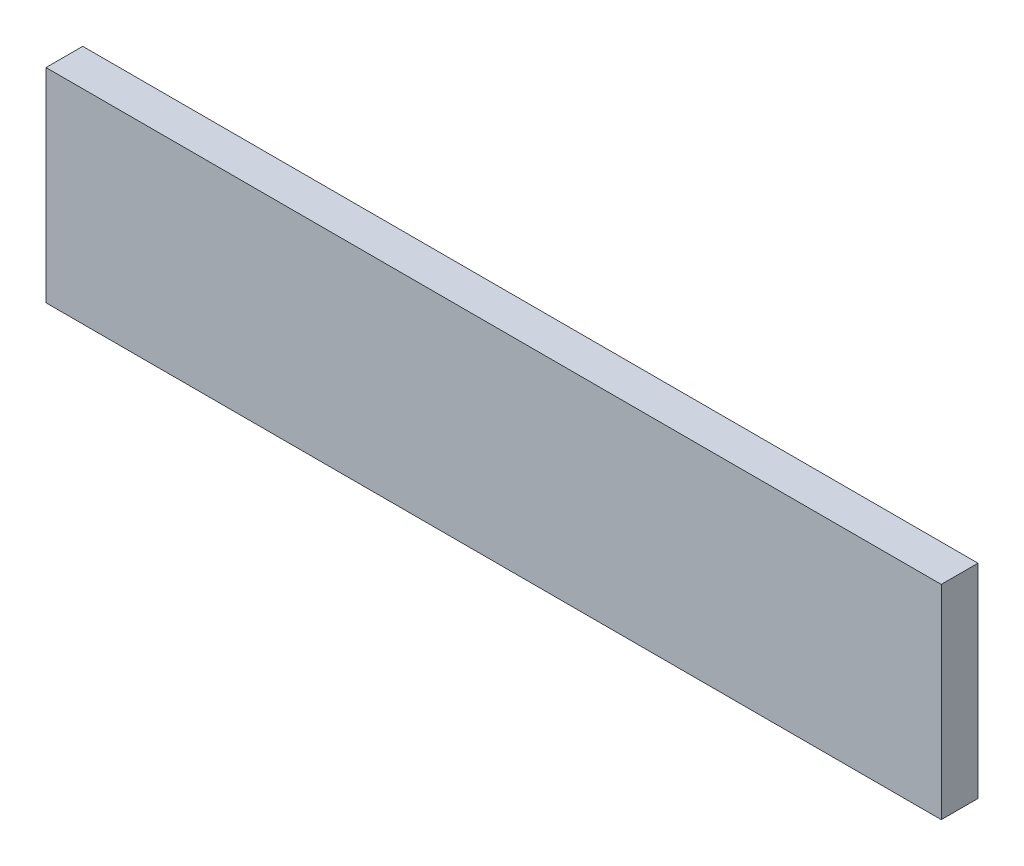
ISO-10303-21;
HEADER;
FILE_DESCRIPTION(('STEP AP214'),'2;1');
FILE_NAME('part.step','',(''),(''),'','','');
FILE_SCHEMA(('AUTOMOTIVE_DESIGN { 1 0 10303 214 1 1 1 1 }'));
ENDSEC;
DATA;
#1=APPLICATION_CONTEXT('core data for automotive mechanical design processes');
#2=APPLICATION_PROTOCOL_DEFINITION('international standard','automotive_design',2000,#1);
#3=PRODUCT_CONTEXT('',#1,'mechanical');
#4=PRODUCT('Part','Part','',(#3));
#5=PRODUCT_RELATED_PRODUCT_CATEGORY('part','',(#4));
#6=PRODUCT_DEFINITION_FORMATION('','',#4);
#7=PRODUCT_DEFINITION_CONTEXT('part definition',#1,'design');
#8=PRODUCT_DEFINITION('design','',#6,#7);
#9=PRODUCT_DEFINITION_SHAPE('','',#8);
#10=(LENGTH_UNIT() NAMED_UNIT(*) SI_UNIT(.MILLI.,.METRE.));
#11=(NAMED_UNIT(*) PLANE_ANGLE_UNIT() SI_UNIT($,.RADIAN.));
#12=(NAMED_UNIT(*) SI_UNIT($,.STERADIAN.) SOLID_ANGLE_UNIT());
#13=UNCERTAINTY_MEASURE_WITH_UNIT(LENGTH_MEASURE(1.E-05),#10,'distance_accuracy_value','');
#14=(GEOMETRIC_REPRESENTATION_CONTEXT(3) GLOBAL_UNCERTAINTY_ASSIGNED_CONTEXT((#13)) GLOBAL_UNIT_ASSIGNED_CONTEXT((#10,
#11,#12)) REPRESENTATION_CONTEXT('',''));
#15=CARTESIAN_POINT('',(0.,0.,0.));
#16=DIRECTION('',(0.,0.,1.));
#17=DIRECTION('',(1.,0.,0.));
#18=AXIS2_PLACEMENT_3D('',#15,#16,#17);
#19=CARTESIAN_POINT('',(268.,-75.,22.));
#20=DIRECTION('',(-1.,0.,0.));
#21=DIRECTION('',(0.,0.,1.));
#22=AXIS2_PLACEMENT_3D('',#19,#20,#21);
#23=PLANE('',#22);
#24=DIRECTION('',(0.,1.,0.));
#25=VECTOR('',#24,1.);
#26=CARTESIAN_POINT('',(268.,-75.,0.));
#27=LINE('',#26,#25);
#28=CARTESIAN_POINT('',(268.,-75.,0.));
#29=VERTEX_POINT('',#28);
#30=CARTESIAN_POINT('',(268.,47.,0.));
#31=VERTEX_POINT('',#30);
#32=EDGE_CURVE('E81',#29,#31,#27,.T.);
#33=ORIENTED_EDGE('',*,*,#32,.T.);
#34=DIRECTION('',(0.,0.,1.));
#35=VECTOR('',#34,1.);
#36=CARTESIAN_POINT('',(268.,47.,0.));
#37=LINE('',#36,#35);
#38=CARTESIAN_POINT('',(268.,47.,22.));
#39=VERTEX_POINT('',#38);
#40=EDGE_CURVE('E47',#31,#39,#37,.T.);
#41=ORIENTED_EDGE('',*,*,#40,.T.);
#42=DIRECTION('',(0.,1.,0.));
#43=VECTOR('',#42,1.);
#44=CARTESIAN_POINT('',(268.,-75.,22.));
#45=LINE('',#44,#43);
#46=CARTESIAN_POINT('',(268.,-75.,22.));
#47=VERTEX_POINT('',#46);
#48=EDGE_CURVE('E76',#47,#39,#45,.T.);
#49=ORIENTED_EDGE('',*,*,#48,.F.);
#50=DIRECTION('',(0.,0.,-1.));
#51=VECTOR('',#50,1.);
#52=CARTESIAN_POINT('',(268.,-75.,22.));
#53=LINE('',#52,#51);
#54=EDGE_CURVE('E40',#47,#29,#53,.T.);
#55=ORIENTED_EDGE('',*,*,#54,.T.);
#56=EDGE_LOOP('',(#33,#41,#49,#55));
#57=FACE_BOUND('',#56,.T.);
#58=ADVANCED_FACE('F33',(#57),#23,.F.);
#59=CARTESIAN_POINT('',(-268.,-75.,22.));
#60=DIRECTION('',(1.,0.,0.));
#61=DIRECTION('',(0.,0.,-1.));
#62=AXIS2_PLACEMENT_3D('',#59,#60,#61);
#63=PLANE('',#62);
#64=DIRECTION('',(0.,-1.,0.));
#65=VECTOR('',#64,1.);
#66=CARTESIAN_POINT('',(-268.,-75.,22.));
#67=LINE('',#66,#65);
#68=CARTESIAN_POINT('',(-268.,47.,22.));
#69=VERTEX_POINT('',#68);
#70=CARTESIAN_POINT('',(-268.,-75.,22.));
#71=VERTEX_POINT('',#70);
#72=EDGE_CURVE('E90',#69,#71,#67,.T.);
#73=ORIENTED_EDGE('',*,*,#72,.F.);
#74=DIRECTION('',(0.,0.,1.));
#75=VECTOR('',#74,1.);
#76=CARTESIAN_POINT('',(-268.,47.,0.));
#77=LINE('',#76,#75);
#78=CARTESIAN_POINT('',(-268.,47.,0.));
#79=VERTEX_POINT('',#78);
#80=EDGE_CURVE('E86',#79,#69,#77,.T.);
#81=ORIENTED_EDGE('',*,*,#80,.F.);
#82=DIRECTION('',(0.,-1.,0.));
#83=VECTOR('',#82,1.);
#84=CARTESIAN_POINT('',(-268.,-75.,0.));
#85=LINE('',#84,#83);
#86=CARTESIAN_POINT('',(-268.,-75.,0.));
#87=VERTEX_POINT('',#86);
#88=EDGE_CURVE('E77',#79,#87,#85,.T.);
#89=ORIENTED_EDGE('',*,*,#88,.T.);
#90=DIRECTION('',(0.,0.,-1.));
#91=VECTOR('',#90,1.);
#92=CARTESIAN_POINT('',(-268.,-75.,22.));
#93=LINE('',#92,#91);
#94=EDGE_CURVE('E11',#71,#87,#93,.T.);
#95=ORIENTED_EDGE('',*,*,#94,.F.);
#96=EDGE_LOOP('',(#73,#81,#89,#95));
#97=FACE_BOUND('',#96,.T.);
#98=ADVANCED_FACE('F112',(#97),#63,.F.);
#99=CARTESIAN_POINT('',(-268.,-75.,22.));
#100=DIRECTION('',(0.,1.,0.));
#101=DIRECTION('',(0.,0.,1.));
#102=AXIS2_PLACEMENT_3D('',#99,#100,#101);
#103=PLANE('',#102);
#104=DIRECTION('',(1.,0.,0.));
#105=VECTOR('',#104,1.);
#106=CARTESIAN_POINT('',(-268.,-75.,0.));
#107=LINE('',#106,#105);
#108=EDGE_CURVE('E68',#87,#29,#107,.T.);
#109=ORIENTED_EDGE('',*,*,#108,.T.);
#110=ORIENTED_EDGE('',*,*,#54,.F.);
#111=DIRECTION('',(1.,0.,0.));
#112=VECTOR('',#111,1.);
#113=CARTESIAN_POINT('',(-268.,-75.,22.));
#114=LINE('',#113,#112);
#115=EDGE_CURVE('E56',#71,#47,#114,.T.);
#116=ORIENTED_EDGE('',*,*,#115,.F.);
#117=ORIENTED_EDGE('',*,*,#94,.T.);
#118=EDGE_LOOP('',(#109,#110,#116,#117));
#119=FACE_BOUND('',#118,.T.);
#120=ADVANCED_FACE('F70',(#119),#103,.F.);
#121=CARTESIAN_POINT('',(0.,0.,22.));
#122=DIRECTION('',(0.,0.,-1.));
#123=DIRECTION('',(-1.,0.,0.));
#124=AXIS2_PLACEMENT_3D('',#121,#122,#123);
#125=PLANE('',#124);
#126=ORIENTED_EDGE('',*,*,#48,.T.);
#127=DIRECTION('',(1.,0.,0.));
#128=VECTOR('',#127,1.);
#129=CARTESIAN_POINT('',(0.,47.,22.));
#130=LINE('',#129,#128);
#131=EDGE_CURVE('E95',#69,#39,#130,.T.);
#132=ORIENTED_EDGE('',*,*,#131,.F.);
#133=ORIENTED_EDGE('',*,*,#72,.T.);
#134=ORIENTED_EDGE('',*,*,#115,.T.);
#135=EDGE_LOOP('',(#126,#132,#133,#134));
#136=FACE_BOUND('',#135,.T.);
#137=ADVANCED_FACE('F103',(#136),#125,.F.);
#138=CARTESIAN_POINT('',(0.,0.,0.));
#139=DIRECTION('',(0.,0.,-1.));
#140=DIRECTION('',(-1.,0.,0.));
#141=AXIS2_PLACEMENT_3D('',#138,#139,#140);
#142=PLANE('',#141);
#143=DIRECTION('',(1.,0.,0.));
#144=VECTOR('',#143,1.);
#145=CARTESIAN_POINT('',(0.,47.,0.));
#146=LINE('',#145,#144);
#147=EDGE_CURVE('E83',#79,#31,#146,.T.);
#148=ORIENTED_EDGE('',*,*,#147,.T.);
#149=ORIENTED_EDGE('',*,*,#32,.F.);
#150=ORIENTED_EDGE('',*,*,#108,.F.);
#151=ORIENTED_EDGE('',*,*,#88,.F.);
#152=EDGE_LOOP('',(#148,#149,#150,#151));
#153=FACE_BOUND('',#152,.T.);
#154=ADVANCED_FACE('F82',(#153),#142,.T.);
#155=CARTESIAN_POINT('',(0.,47.,0.));
#156=DIRECTION('',(0.,-1.,0.));
#157=DIRECTION('',(0.,0.,-1.));
#158=AXIS2_PLACEMENT_3D('',#155,#156,#157);
#159=PLANE('',#158);
#160=ORIENTED_EDGE('',*,*,#131,.T.);
#161=ORIENTED_EDGE('',*,*,#40,.F.);
#162=ORIENTED_EDGE('',*,*,#147,.F.);
#163=ORIENTED_EDGE('',*,*,#80,.T.);
#164=EDGE_LOOP('',(#160,#161,#162,#163));
#165=FACE_BOUND('',#164,.T.);
#166=ADVANCED_FACE('F99',(#165),#159,.F.);
#167=CLOSED_SHELL('',(#58,#98,#120,#137,#154,#166));
#168=MANIFOLD_SOLID_BREP('B2',#167);
#169=ADVANCED_BREP_SHAPE_REPRESENTATION('',(#18,#168),#14);
#170=SHAPE_DEFINITION_REPRESENTATION(#9,#169);
ENDSEC;
END-ISO-10303-21;
